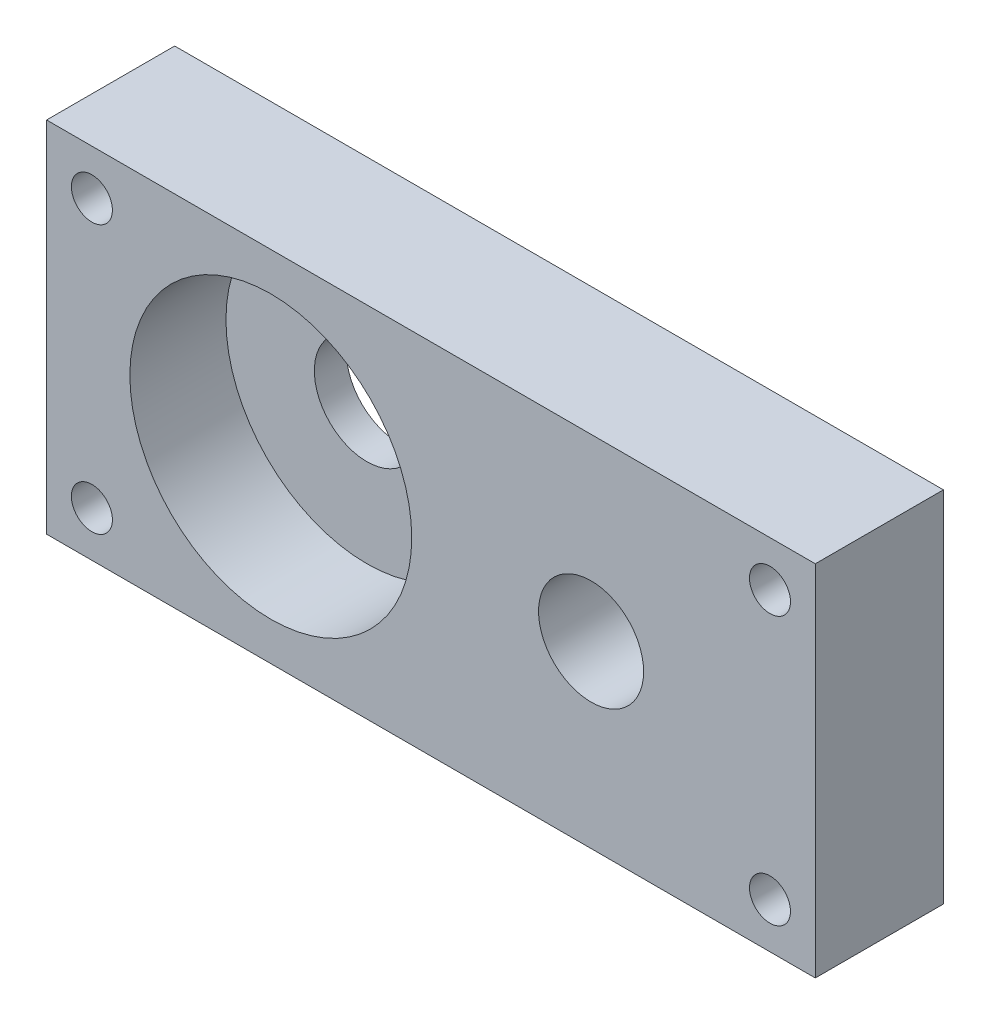
ISO-10303-21;
HEADER;
FILE_DESCRIPTION(('STEP AP214'),'2;1');
FILE_NAME('part.step','',(''),(''),'','','');
FILE_SCHEMA(('AUTOMOTIVE_DESIGN { 1 0 10303 214 1 1 1 1 }'));
ENDSEC;
DATA;
#1=APPLICATION_CONTEXT('core data for automotive mechanical design processes');
#2=APPLICATION_PROTOCOL_DEFINITION('international standard','automotive_design',2000,#1);
#3=PRODUCT_CONTEXT('',#1,'mechanical');
#4=PRODUCT('Part','Part','',(#3));
#5=PRODUCT_RELATED_PRODUCT_CATEGORY('part','',(#4));
#6=PRODUCT_DEFINITION_FORMATION('','',#4);
#7=PRODUCT_DEFINITION_CONTEXT('part definition',#1,'design');
#8=PRODUCT_DEFINITION('design','',#6,#7);
#9=PRODUCT_DEFINITION_SHAPE('','',#8);
#10=(LENGTH_UNIT() NAMED_UNIT(*) SI_UNIT(.MILLI.,.METRE.));
#11=(NAMED_UNIT(*) PLANE_ANGLE_UNIT() SI_UNIT($,.RADIAN.));
#12=(NAMED_UNIT(*) SI_UNIT($,.STERADIAN.) SOLID_ANGLE_UNIT());
#13=UNCERTAINTY_MEASURE_WITH_UNIT(LENGTH_MEASURE(1.E-05),#10,'distance_accuracy_value','');
#14=(GEOMETRIC_REPRESENTATION_CONTEXT(3) GLOBAL_UNCERTAINTY_ASSIGNED_CONTEXT((#13)) GLOBAL_UNIT_ASSIGNED_CONTEXT((#10,
#11,#12)) REPRESENTATION_CONTEXT('',''));
#15=CARTESIAN_POINT('',(0.,0.,0.));
#16=DIRECTION('',(0.,0.,1.));
#17=DIRECTION('',(1.,0.,0.));
#18=AXIS2_PLACEMENT_3D('',#15,#16,#17);
#19=CARTESIAN_POINT('',(-12.5,0.,10.));
#20=DIRECTION('',(0.,0.,-1.));
#21=DIRECTION('',(-1.,0.,0.));
#22=AXIS2_PLACEMENT_3D('',#19,#20,#21);
#23=CYLINDRICAL_SURFACE('',#22,4.1);
#24=CARTESIAN_POINT('',(-12.5,0.,0.));
#25=DIRECTION('',(0.,0.,1.));
#26=DIRECTION('',(1.,0.,0.));
#27=AXIS2_PLACEMENT_3D('',#24,#25,#26);
#28=CIRCLE('',#27,4.1);
#29=CARTESIAN_POINT('',(-8.4,0.,0.));
#30=VERTEX_POINT('',#29);
#31=EDGE_CURVE('E119',#30,#30,#28,.T.);
#32=ORIENTED_EDGE('',*,*,#31,.F.);
#33=EDGE_LOOP('',(#32));
#34=FACE_BOUND('',#33,.T.);
#35=CARTESIAN_POINT('',(-12.5,0.,2.5));
#36=DIRECTION('',(0.,0.,1.));
#37=DIRECTION('',(1.,0.,0.));
#38=AXIS2_PLACEMENT_3D('',#35,#36,#37);
#39=CIRCLE('',#38,4.1);
#40=CARTESIAN_POINT('',(-8.4,0.,2.5));
#41=VERTEX_POINT('',#40);
#42=EDGE_CURVE('E38',#41,#41,#39,.T.);
#43=ORIENTED_EDGE('',*,*,#42,.T.);
#44=EDGE_LOOP('',(#43));
#45=FACE_BOUND('',#44,.T.);
#46=ADVANCED_FACE('F34',(#34,#45),#23,.F.);
#47=CARTESIAN_POINT('',(0.,0.,10.));
#48=DIRECTION('',(0.,0.,1.));
#49=DIRECTION('',(1.,0.,0.));
#50=AXIS2_PLACEMENT_3D('',#47,#48,#49);
#51=PLANE('',#50);
#52=CARTESIAN_POINT('',(-12.5,0.,10.));
#53=DIRECTION('',(0.,0.,1.));
#54=DIRECTION('',(1.,0.,0.));
#55=AXIS2_PLACEMENT_3D('',#52,#53,#54);
#56=CIRCLE('',#55,11.);
#57=CARTESIAN_POINT('',(-1.5,0.,10.));
#58=VERTEX_POINT('',#57);
#59=EDGE_CURVE('E148',#58,#58,#56,.T.);
#60=ORIENTED_EDGE('',*,*,#59,.F.);
#61=EDGE_LOOP('',(#60));
#62=FACE_BOUND('',#61,.T.);
#63=CARTESIAN_POINT('',(26.4644660940674,-10.4644660940672,10.));
#64=DIRECTION('',(0.,0.,1.));
#65=DIRECTION('',(-1.,0.,0.));
#66=AXIS2_PLACEMENT_3D('',#63,#64,#65);
#67=CIRCLE('',#66,1.6);
#68=CARTESIAN_POINT('',(24.8644660940673,-10.4644660940672,10.));
#69=VERTEX_POINT('',#68);
#70=EDGE_CURVE('E134',#69,#69,#67,.T.);
#71=ORIENTED_EDGE('',*,*,#70,.F.);
#72=EDGE_LOOP('',(#71));
#73=FACE_BOUND('',#72,.T.);
#74=CARTESIAN_POINT('',(-26.4644660940673,10.4644660940673,10.));
#75=DIRECTION('',(0.,0.,1.));
#76=DIRECTION('',(1.,0.,0.));
#77=AXIS2_PLACEMENT_3D('',#74,#75,#76);
#78=CIRCLE('',#77,1.6);
#79=CARTESIAN_POINT('',(-24.8644660940673,10.4644660940673,10.));
#80=VERTEX_POINT('',#79);
#81=EDGE_CURVE('E124',#80,#80,#78,.T.);
#82=ORIENTED_EDGE('',*,*,#81,.F.);
#83=EDGE_LOOP('',(#82));
#84=FACE_BOUND('',#83,.T.);
#85=CARTESIAN_POINT('',(12.5,0.,10.));
#86=DIRECTION('',(0.,0.,1.));
#87=DIRECTION('',(1.,0.,0.));
#88=AXIS2_PLACEMENT_3D('',#85,#86,#87);
#89=CIRCLE('',#88,4.1);
#90=CARTESIAN_POINT('',(16.6,0.,10.));
#91=VERTEX_POINT('',#90);
#92=EDGE_CURVE('E104',#91,#91,#89,.T.);
#93=ORIENTED_EDGE('',*,*,#92,.F.);
#94=EDGE_LOOP('',(#93));
#95=FACE_BOUND('',#94,.T.);
#96=DIRECTION('',(0.,-1.,0.));
#97=VECTOR('',#96,1.);
#98=CARTESIAN_POINT('',(-30.,-14.,10.));
#99=LINE('',#98,#97);
#100=CARTESIAN_POINT('',(-30.,14.,10.));
#101=VERTEX_POINT('',#100);
#102=CARTESIAN_POINT('',(-30.,-14.,10.));
#103=VERTEX_POINT('',#102);
#104=EDGE_CURVE('E88',#101,#103,#99,.T.);
#105=ORIENTED_EDGE('',*,*,#104,.T.);
#106=DIRECTION('',(1.,0.,0.));
#107=VECTOR('',#106,1.);
#108=CARTESIAN_POINT('',(30.,-14.,10.));
#109=LINE('',#108,#107);
#110=CARTESIAN_POINT('',(30.,-14.,10.));
#111=VERTEX_POINT('',#110);
#112=EDGE_CURVE('E82',#103,#111,#109,.T.);
#113=ORIENTED_EDGE('',*,*,#112,.T.);
#114=DIRECTION('',(0.,1.,0.));
#115=VECTOR('',#114,1.);
#116=CARTESIAN_POINT('',(30.,-14.,10.));
#117=LINE('',#116,#115);
#118=CARTESIAN_POINT('',(30.,14.,10.));
#119=VERTEX_POINT('',#118);
#120=EDGE_CURVE('E86',#111,#119,#117,.T.);
#121=ORIENTED_EDGE('',*,*,#120,.T.);
#122=DIRECTION('',(-1.,0.,0.));
#123=VECTOR('',#122,1.);
#124=CARTESIAN_POINT('',(30.,14.,10.));
#125=LINE('',#124,#123);
#126=EDGE_CURVE('E52',#119,#101,#125,.T.);
#127=ORIENTED_EDGE('',*,*,#126,.T.);
#128=EDGE_LOOP('',(#105,#113,#121,#127));
#129=FACE_BOUND('',#128,.T.);
#130=CARTESIAN_POINT('',(-26.4644660940673,-10.4644660940673,10.));
#131=DIRECTION('',(0.,0.,1.));
#132=DIRECTION('',(1.,0.,0.));
#133=AXIS2_PLACEMENT_3D('',#130,#131,#132);
#134=CIRCLE('',#133,1.6);
#135=CARTESIAN_POINT('',(-24.8644660940673,-10.4644660940673,10.));
#136=VERTEX_POINT('',#135);
#137=EDGE_CURVE('E128',#136,#136,#134,.T.);
#138=ORIENTED_EDGE('',*,*,#137,.F.);
#139=EDGE_LOOP('',(#138));
#140=FACE_BOUND('',#139,.T.);
#141=CARTESIAN_POINT('',(26.4644660940673,10.4644660940674,10.));
#142=DIRECTION('',(0.,0.,1.));
#143=DIRECTION('',(-1.,0.,0.));
#144=AXIS2_PLACEMENT_3D('',#141,#142,#143);
#145=CIRCLE('',#144,1.6);
#146=CARTESIAN_POINT('',(24.8644660940673,10.4644660940674,10.));
#147=VERTEX_POINT('',#146);
#148=EDGE_CURVE('E140',#147,#147,#145,.T.);
#149=ORIENTED_EDGE('',*,*,#148,.F.);
#150=EDGE_LOOP('',(#149));
#151=FACE_BOUND('',#150,.T.);
#152=ADVANCED_FACE('F83',(#62,#73,#84,#95,#129,#140,#151),#51,.T.);
#153=CARTESIAN_POINT('',(0.,0.,0.));
#154=DIRECTION('',(0.,0.,1.));
#155=DIRECTION('',(1.,0.,0.));
#156=AXIS2_PLACEMENT_3D('',#153,#154,#155);
#157=PLANE('',#156);
#158=DIRECTION('',(0.,-1.,0.));
#159=VECTOR('',#158,1.);
#160=CARTESIAN_POINT('',(-30.,-14.,0.));
#161=LINE('',#160,#159);
#162=CARTESIAN_POINT('',(-30.,14.,0.));
#163=VERTEX_POINT('',#162);
#164=CARTESIAN_POINT('',(-30.,-14.,0.));
#165=VERTEX_POINT('',#164);
#166=EDGE_CURVE('E101',#163,#165,#161,.T.);
#167=ORIENTED_EDGE('',*,*,#166,.F.);
#168=DIRECTION('',(-1.,0.,0.));
#169=VECTOR('',#168,1.);
#170=CARTESIAN_POINT('',(30.,14.,0.));
#171=LINE('',#170,#169);
#172=CARTESIAN_POINT('',(30.,14.,0.));
#173=VERTEX_POINT('',#172);
#174=EDGE_CURVE('E75',#173,#163,#171,.T.);
#175=ORIENTED_EDGE('',*,*,#174,.F.);
#176=DIRECTION('',(0.,1.,0.));
#177=VECTOR('',#176,1.);
#178=CARTESIAN_POINT('',(30.,-14.,0.));
#179=LINE('',#178,#177);
#180=CARTESIAN_POINT('',(30.,-14.,0.));
#181=VERTEX_POINT('',#180);
#182=EDGE_CURVE('E69',#181,#173,#179,.T.);
#183=ORIENTED_EDGE('',*,*,#182,.F.);
#184=DIRECTION('',(1.,0.,0.));
#185=VECTOR('',#184,1.);
#186=CARTESIAN_POINT('',(30.,-14.,0.));
#187=LINE('',#186,#185);
#188=EDGE_CURVE('E92',#165,#181,#187,.T.);
#189=ORIENTED_EDGE('',*,*,#188,.F.);
#190=EDGE_LOOP('',(#167,#175,#183,#189));
#191=FACE_BOUND('',#190,.T.);
#192=CARTESIAN_POINT('',(12.5,0.,0.));
#193=DIRECTION('',(0.,0.,1.));
#194=DIRECTION('',(1.,0.,0.));
#195=AXIS2_PLACEMENT_3D('',#192,#193,#194);
#196=CIRCLE('',#195,4.1);
#197=CARTESIAN_POINT('',(16.6,0.,0.));
#198=VERTEX_POINT('',#197);
#199=EDGE_CURVE('E116',#198,#198,#196,.T.);
#200=ORIENTED_EDGE('',*,*,#199,.T.);
#201=EDGE_LOOP('',(#200));
#202=FACE_BOUND('',#201,.T.);
#203=ORIENTED_EDGE('',*,*,#31,.T.);
#204=EDGE_LOOP('',(#203));
#205=FACE_BOUND('',#204,.T.);
#206=CARTESIAN_POINT('',(-26.4644660940673,10.4644660940673,0.));
#207=DIRECTION('',(0.,0.,1.));
#208=DIRECTION('',(1.,0.,0.));
#209=AXIS2_PLACEMENT_3D('',#206,#207,#208);
#210=CIRCLE('',#209,1.6);
#211=CARTESIAN_POINT('',(-24.8644660940673,10.4644660940673,0.));
#212=VERTEX_POINT('',#211);
#213=EDGE_CURVE('E125',#212,#212,#210,.T.);
#214=ORIENTED_EDGE('',*,*,#213,.T.);
#215=EDGE_LOOP('',(#214));
#216=FACE_BOUND('',#215,.T.);
#217=CARTESIAN_POINT('',(-26.4644660940673,-10.4644660940673,0.));
#218=DIRECTION('',(0.,0.,1.));
#219=DIRECTION('',(1.,0.,0.));
#220=AXIS2_PLACEMENT_3D('',#217,#218,#219);
#221=CIRCLE('',#220,1.6);
#222=CARTESIAN_POINT('',(-24.8644660940673,-10.4644660940673,0.));
#223=VERTEX_POINT('',#222);
#224=EDGE_CURVE('E131',#223,#223,#221,.T.);
#225=ORIENTED_EDGE('',*,*,#224,.T.);
#226=EDGE_LOOP('',(#225));
#227=FACE_BOUND('',#226,.T.);
#228=CARTESIAN_POINT('',(26.4644660940674,-10.4644660940672,0.));
#229=DIRECTION('',(0.,0.,1.));
#230=DIRECTION('',(-1.,0.,0.));
#231=AXIS2_PLACEMENT_3D('',#228,#229,#230);
#232=CIRCLE('',#231,1.6);
#233=CARTESIAN_POINT('',(24.8644660940673,-10.4644660940672,0.));
#234=VERTEX_POINT('',#233);
#235=EDGE_CURVE('E137',#234,#234,#232,.T.);
#236=ORIENTED_EDGE('',*,*,#235,.T.);
#237=EDGE_LOOP('',(#236));
#238=FACE_BOUND('',#237,.T.);
#239=CARTESIAN_POINT('',(26.4644660940673,10.4644660940674,0.));
#240=DIRECTION('',(0.,0.,1.));
#241=DIRECTION('',(-1.,0.,0.));
#242=AXIS2_PLACEMENT_3D('',#239,#240,#241);
#243=CIRCLE('',#242,1.6);
#244=CARTESIAN_POINT('',(24.8644660940673,10.4644660940674,0.));
#245=VERTEX_POINT('',#244);
#246=EDGE_CURVE('E143',#245,#245,#243,.T.);
#247=ORIENTED_EDGE('',*,*,#246,.T.);
#248=EDGE_LOOP('',(#247));
#249=FACE_BOUND('',#248,.T.);
#250=ADVANCED_FACE('F112',(#191,#202,#205,#216,#227,#238,#249),#157,.F.);
#251=CARTESIAN_POINT('',(-30.,-14.,10.));
#252=DIRECTION('',(1.,0.,0.));
#253=DIRECTION('',(0.,0.,-1.));
#254=AXIS2_PLACEMENT_3D('',#251,#252,#253);
#255=PLANE('',#254);
#256=ORIENTED_EDGE('',*,*,#166,.T.);
#257=DIRECTION('',(0.,0.,-1.));
#258=VECTOR('',#257,1.);
#259=CARTESIAN_POINT('',(-30.,-14.,10.));
#260=LINE('',#259,#258);
#261=EDGE_CURVE('E11',#103,#165,#260,.T.);
#262=ORIENTED_EDGE('',*,*,#261,.F.);
#263=ORIENTED_EDGE('',*,*,#104,.F.);
#264=DIRECTION('',(0.,0.,-1.));
#265=VECTOR('',#264,1.);
#266=CARTESIAN_POINT('',(-30.,14.,10.));
#267=LINE('',#266,#265);
#268=EDGE_CURVE('E97',#101,#163,#267,.T.);
#269=ORIENTED_EDGE('',*,*,#268,.T.);
#270=EDGE_LOOP('',(#256,#262,#263,#269));
#271=FACE_BOUND('',#270,.T.);
#272=ADVANCED_FACE('F36',(#271),#255,.F.);
#273=CARTESIAN_POINT('',(30.,-14.,10.));
#274=DIRECTION('',(0.,1.,0.));
#275=DIRECTION('',(-1.,0.,0.));
#276=AXIS2_PLACEMENT_3D('',#273,#274,#275);
#277=PLANE('',#276);
#278=ORIENTED_EDGE('',*,*,#188,.T.);
#279=DIRECTION('',(0.,0.,-1.));
#280=VECTOR('',#279,1.);
#281=CARTESIAN_POINT('',(30.,-14.,10.));
#282=LINE('',#281,#280);
#283=EDGE_CURVE('E44',#111,#181,#282,.T.);
#284=ORIENTED_EDGE('',*,*,#283,.F.);
#285=ORIENTED_EDGE('',*,*,#112,.F.);
#286=ORIENTED_EDGE('',*,*,#261,.T.);
#287=EDGE_LOOP('',(#278,#284,#285,#286));
#288=FACE_BOUND('',#287,.T.);
#289=ADVANCED_FACE('F91',(#288),#277,.F.);
#290=CARTESIAN_POINT('',(30.,-14.,10.));
#291=DIRECTION('',(-1.,0.,0.));
#292=DIRECTION('',(0.,0.,1.));
#293=AXIS2_PLACEMENT_3D('',#290,#291,#292);
#294=PLANE('',#293);
#295=ORIENTED_EDGE('',*,*,#182,.T.);
#296=DIRECTION('',(0.,0.,-1.));
#297=VECTOR('',#296,1.);
#298=CARTESIAN_POINT('',(30.,14.,10.));
#299=LINE('',#298,#297);
#300=EDGE_CURVE('E93',#119,#173,#299,.T.);
#301=ORIENTED_EDGE('',*,*,#300,.F.);
#302=ORIENTED_EDGE('',*,*,#120,.F.);
#303=ORIENTED_EDGE('',*,*,#283,.T.);
#304=EDGE_LOOP('',(#295,#301,#302,#303));
#305=FACE_BOUND('',#304,.T.);
#306=ADVANCED_FACE('F95',(#305),#294,.F.);
#307=CARTESIAN_POINT('',(30.,14.,10.));
#308=DIRECTION('',(0.,-1.,0.));
#309=DIRECTION('',(1.,0.,0.));
#310=AXIS2_PLACEMENT_3D('',#307,#308,#309);
#311=PLANE('',#310);
#312=ORIENTED_EDGE('',*,*,#174,.T.);
#313=ORIENTED_EDGE('',*,*,#268,.F.);
#314=ORIENTED_EDGE('',*,*,#126,.F.);
#315=ORIENTED_EDGE('',*,*,#300,.T.);
#316=EDGE_LOOP('',(#312,#313,#314,#315));
#317=FACE_BOUND('',#316,.T.);
#318=ADVANCED_FACE('F109',(#317),#311,.F.);
#319=CARTESIAN_POINT('',(12.5,0.,10.));
#320=DIRECTION('',(0.,0.,-1.));
#321=DIRECTION('',(-1.,0.,0.));
#322=AXIS2_PLACEMENT_3D('',#319,#320,#321);
#323=CYLINDRICAL_SURFACE('',#322,4.1);
#324=ORIENTED_EDGE('',*,*,#92,.T.);
#325=EDGE_LOOP('',(#324));
#326=FACE_BOUND('',#325,.T.);
#327=ORIENTED_EDGE('',*,*,#199,.F.);
#328=EDGE_LOOP('',(#327));
#329=FACE_BOUND('',#328,.T.);
#330=ADVANCED_FACE('F182',(#326,#329),#323,.F.);
#331=CARTESIAN_POINT('',(-26.4644660940673,10.4644660940673,10.));
#332=DIRECTION('',(0.,0.,-1.));
#333=DIRECTION('',(-1.,0.,0.));
#334=AXIS2_PLACEMENT_3D('',#331,#332,#333);
#335=CYLINDRICAL_SURFACE('',#334,1.6);
#336=ORIENTED_EDGE('',*,*,#81,.T.);
#337=EDGE_LOOP('',(#336));
#338=FACE_BOUND('',#337,.T.);
#339=ORIENTED_EDGE('',*,*,#213,.F.);
#340=EDGE_LOOP('',(#339));
#341=FACE_BOUND('',#340,.T.);
#342=ADVANCED_FACE('F180',(#338,#341),#335,.F.);
#343=CARTESIAN_POINT('',(-26.4644660940673,-10.4644660940673,10.));
#344=DIRECTION('',(0.,0.,-1.));
#345=DIRECTION('',(-1.,0.,0.));
#346=AXIS2_PLACEMENT_3D('',#343,#344,#345);
#347=CYLINDRICAL_SURFACE('',#346,1.6);
#348=ORIENTED_EDGE('',*,*,#137,.T.);
#349=EDGE_LOOP('',(#348));
#350=FACE_BOUND('',#349,.T.);
#351=ORIENTED_EDGE('',*,*,#224,.F.);
#352=EDGE_LOOP('',(#351));
#353=FACE_BOUND('',#352,.T.);
#354=ADVANCED_FACE('F233',(#350,#353),#347,.F.);
#355=CARTESIAN_POINT('',(26.4644660940674,-10.4644660940672,10.));
#356=DIRECTION('',(0.,0.,-1.));
#357=DIRECTION('',(-1.,0.,0.));
#358=AXIS2_PLACEMENT_3D('',#355,#356,#357);
#359=CYLINDRICAL_SURFACE('',#358,1.6);
#360=ORIENTED_EDGE('',*,*,#70,.T.);
#361=EDGE_LOOP('',(#360));
#362=FACE_BOUND('',#361,.T.);
#363=ORIENTED_EDGE('',*,*,#235,.F.);
#364=EDGE_LOOP('',(#363));
#365=FACE_BOUND('',#364,.T.);
#366=ADVANCED_FACE('F225',(#362,#365),#359,.F.);
#367=CARTESIAN_POINT('',(26.4644660940673,10.4644660940674,10.));
#368=DIRECTION('',(0.,0.,-1.));
#369=DIRECTION('',(-1.,0.,0.));
#370=AXIS2_PLACEMENT_3D('',#367,#368,#369);
#371=CYLINDRICAL_SURFACE('',#370,1.6);
#372=ORIENTED_EDGE('',*,*,#148,.T.);
#373=EDGE_LOOP('',(#372));
#374=FACE_BOUND('',#373,.T.);
#375=ORIENTED_EDGE('',*,*,#246,.F.);
#376=EDGE_LOOP('',(#375));
#377=FACE_BOUND('',#376,.T.);
#378=ADVANCED_FACE('F166',(#374,#377),#371,.F.);
#379=CARTESIAN_POINT('',(-12.5,0.,2.5));
#380=DIRECTION('',(0.,0.,1.));
#381=DIRECTION('',(1.,0.,0.));
#382=AXIS2_PLACEMENT_3D('',#379,#380,#381);
#383=CYLINDRICAL_SURFACE('',#382,11.);
#384=CARTESIAN_POINT('',(-12.5,0.,2.5));
#385=DIRECTION('',(0.,0.,1.));
#386=DIRECTION('',(1.,0.,0.));
#387=AXIS2_PLACEMENT_3D('',#384,#385,#386);
#388=CIRCLE('',#387,11.);
#389=CARTESIAN_POINT('',(-1.5,0.,2.5));
#390=VERTEX_POINT('',#389);
#391=EDGE_CURVE('E151',#390,#390,#388,.T.);
#392=ORIENTED_EDGE('',*,*,#391,.F.);
#393=EDGE_LOOP('',(#392));
#394=FACE_BOUND('',#393,.T.);
#395=ORIENTED_EDGE('',*,*,#59,.T.);
#396=EDGE_LOOP('',(#395));
#397=FACE_BOUND('',#396,.T.);
#398=ADVANCED_FACE('F161',(#394,#397),#383,.F.);
#399=CARTESIAN_POINT('',(-12.5,0.,2.5));
#400=DIRECTION('',(0.,0.,1.));
#401=DIRECTION('',(1.,0.,0.));
#402=AXIS2_PLACEMENT_3D('',#399,#400,#401);
#403=PLANE('',#402);
#404=ORIENTED_EDGE('',*,*,#42,.F.);
#405=EDGE_LOOP('',(#404));
#406=FACE_BOUND('',#405,.T.);
#407=ORIENTED_EDGE('',*,*,#391,.T.);
#408=EDGE_LOOP('',(#407));
#409=FACE_BOUND('',#408,.T.);
#410=ADVANCED_FACE('F159',(#406,#409),#403,.T.);
#411=CLOSED_SHELL('',(#46,#152,#250,#272,#289,#306,#318,#330,#342,#354,#366,#378,#398,#410));
#412=MANIFOLD_SOLID_BREP('B2',#411);
#413=ADVANCED_BREP_SHAPE_REPRESENTATION('',(#18,#412),#14);
#414=SHAPE_DEFINITION_REPRESENTATION(#9,#413);
ENDSEC;
END-ISO-10303-21;
